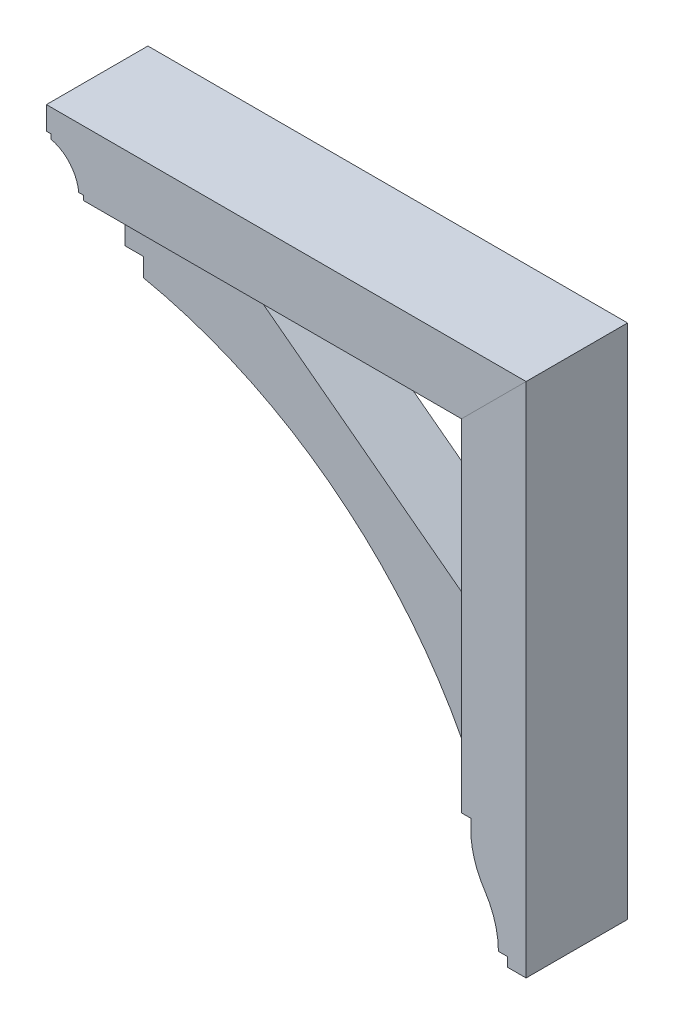
ISO-10303-21;
HEADER;
FILE_DESCRIPTION(('STEP AP214'),'2;1');
FILE_NAME('part.step','',(''),(''),'','','');
FILE_SCHEMA(('AUTOMOTIVE_DESIGN { 1 0 10303 214 1 1 1 1 }'));
ENDSEC;
DATA;
#1=APPLICATION_CONTEXT('core data for automotive mechanical design processes');
#2=APPLICATION_PROTOCOL_DEFINITION('international standard','automotive_design',2000,#1);
#3=PRODUCT_CONTEXT('',#1,'mechanical');
#4=PRODUCT('Part','Part','',(#3));
#5=PRODUCT_RELATED_PRODUCT_CATEGORY('part','',(#4));
#6=PRODUCT_DEFINITION_FORMATION('','',#4);
#7=PRODUCT_DEFINITION_CONTEXT('part definition',#1,'design');
#8=PRODUCT_DEFINITION('design','',#6,#7);
#9=PRODUCT_DEFINITION_SHAPE('','',#8);
#10=(LENGTH_UNIT() NAMED_UNIT(*) SI_UNIT(.MILLI.,.METRE.));
#11=(NAMED_UNIT(*) PLANE_ANGLE_UNIT() SI_UNIT($,.RADIAN.));
#12=(NAMED_UNIT(*) SI_UNIT($,.STERADIAN.) SOLID_ANGLE_UNIT());
#13=UNCERTAINTY_MEASURE_WITH_UNIT(LENGTH_MEASURE(1.E-05),#10,'distance_accuracy_value','');
#14=(GEOMETRIC_REPRESENTATION_CONTEXT(3) GLOBAL_UNCERTAINTY_ASSIGNED_CONTEXT((#13)) GLOBAL_UNIT_ASSIGNED_CONTEXT((#10,
#11,#12)) REPRESENTATION_CONTEXT('',''));
#15=CARTESIAN_POINT('',(0.,0.,0.));
#16=DIRECTION('',(0.,0.,1.));
#17=DIRECTION('',(1.,0.,0.));
#18=AXIS2_PLACEMENT_3D('',#15,#16,#17);
#19=CARTESIAN_POINT('',(246.881223015558,-2.15821431605898E-12,69.85));
#20=DIRECTION('',(1.,0.,0.));
#21=DIRECTION('',(0.,1.,0.));
#22=AXIS2_PLACEMENT_3D('',#19,#20,#21);
#23=PLANE('',#22);
#24=DIRECTION('',(0.,-1.,0.));
#25=VECTOR('',#24,1.);
#26=CARTESIAN_POINT('',(246.881223015558,-2.15821431605898E-12,-69.85));
#27=LINE('',#26,#25);
#28=CARTESIAN_POINT('',(246.881223015556,-183.515,-69.85));
#29=VERTEX_POINT('',#28);
#30=CARTESIAN_POINT('',(246.881223015556,-196.215,-69.85));
#31=VERTEX_POINT('',#30);
#32=EDGE_CURVE('E170',#29,#31,#27,.T.);
#33=ORIENTED_EDGE('',*,*,#32,.T.);
#34=DIRECTION('',(0.,0.,-1.));
#35=VECTOR('',#34,1.);
#36=CARTESIAN_POINT('',(246.881223015556,-196.215,69.85));
#37=LINE('',#36,#35);
#38=CARTESIAN_POINT('',(246.881223015556,-196.215,69.85));
#39=VERTEX_POINT('',#38);
#40=EDGE_CURVE('E12',#39,#31,#37,.T.);
#41=ORIENTED_EDGE('',*,*,#40,.F.);
#42=DIRECTION('',(0.,-1.,0.));
#43=VECTOR('',#42,1.);
#44=CARTESIAN_POINT('',(246.881223015558,-2.15821431605898E-12,69.85));
#45=LINE('',#44,#43);
#46=CARTESIAN_POINT('',(246.881223015556,-183.515,69.85));
#47=VERTEX_POINT('',#46);
#48=EDGE_CURVE('E203',#47,#39,#45,.T.);
#49=ORIENTED_EDGE('',*,*,#48,.F.);
#50=DIRECTION('',(0.,0.,-1.));
#51=VECTOR('',#50,1.);
#52=CARTESIAN_POINT('',(246.881223015556,-183.515,69.85));
#53=LINE('',#52,#51);
#54=EDGE_CURVE('E166',#47,#29,#53,.T.);
#55=ORIENTED_EDGE('',*,*,#54,.T.);
#56=EDGE_LOOP('',(#33,#41,#49,#55));
#57=FACE_BOUND('',#56,.T.);
#58=ADVANCED_FACE('F56',(#57),#23,.F.);
#59=CARTESIAN_POINT('',(362.768723015556,-196.215,69.85));
#60=DIRECTION('',(0.,0.,-1.));
#61=DIRECTION('',(-1.,0.,0.));
#62=AXIS2_PLACEMENT_3D('',#59,#60,#61);
#63=CYLINDRICAL_SURFACE('',#62,115.8875);
#64=CARTESIAN_POINT('',(362.768723015556,-196.215,-69.85));
#65=DIRECTION('',(0.,0.,1.));
#66=DIRECTION('',(1.,0.,0.));
#67=AXIS2_PLACEMENT_3D('',#64,#65,#66);
#68=CIRCLE('',#67,115.8875);
#69=CARTESIAN_POINT('',(266.018608336656,-260.006284403669,-69.85));
#70=VERTEX_POINT('',#69);
#71=EDGE_CURVE('E174',#31,#70,#68,.T.);
#72=ORIENTED_EDGE('',*,*,#71,.T.);
#73=DIRECTION('',(0.,0.,-1.));
#74=VECTOR('',#73,1.);
#75=CARTESIAN_POINT('',(266.018608336656,-260.006284403669,69.85));
#76=LINE('',#75,#74);
#77=CARTESIAN_POINT('',(266.018608336656,-260.006284403669,69.85));
#78=VERTEX_POINT('',#77);
#79=EDGE_CURVE('E65',#78,#70,#76,.T.);
#80=ORIENTED_EDGE('',*,*,#79,.F.);
#81=CARTESIAN_POINT('',(362.768723015556,-196.215,69.85));
#82=DIRECTION('',(0.,0.,1.));
#83=DIRECTION('',(1.,0.,0.));
#84=AXIS2_PLACEMENT_3D('',#81,#82,#83);
#85=CIRCLE('',#84,115.8875);
#86=EDGE_CURVE('E122',#39,#78,#85,.T.);
#87=ORIENTED_EDGE('',*,*,#86,.F.);
#88=ORIENTED_EDGE('',*,*,#40,.T.);
#89=EDGE_LOOP('',(#72,#80,#87,#88));
#90=FACE_BOUND('',#89,.T.);
#91=ADVANCED_FACE('F228',(#90),#63,.T.);
#92=CARTESIAN_POINT('',(170.152056348885,-323.215,69.85));
#93=DIRECTION('',(0.,0.,-1.));
#94=DIRECTION('',(-1.,0.,0.));
#95=AXIS2_PLACEMENT_3D('',#92,#93,#94);
#96=CYLINDRICAL_SURFACE('',#95,114.82916666667);
#97=CARTESIAN_POINT('',(170.152056348885,-323.215,-69.85));
#98=DIRECTION('',(0.,0.,1.));
#99=DIRECTION('',(1.,0.,0.));
#100=AXIS2_PLACEMENT_3D('',#97,#98,#99);
#101=CIRCLE('',#100,114.82916666667);
#102=CARTESIAN_POINT('',(284.981223015555,-323.215,-69.85));
#103=VERTEX_POINT('',#102);
#104=EDGE_CURVE('E178',#103,#70,#101,.T.);
#105=ORIENTED_EDGE('',*,*,#104,.F.);
#106=DIRECTION('',(0.,0.,-1.));
#107=VECTOR('',#106,1.);
#108=CARTESIAN_POINT('',(284.981223015555,-323.215,69.85));
#109=LINE('',#108,#107);
#110=CARTESIAN_POINT('',(284.981223015555,-323.215,69.85));
#111=VERTEX_POINT('',#110);
#112=EDGE_CURVE('E219',#111,#103,#109,.T.);
#113=ORIENTED_EDGE('',*,*,#112,.F.);
#114=CARTESIAN_POINT('',(170.152056348885,-323.215,69.85));
#115=DIRECTION('',(0.,0.,1.));
#116=DIRECTION('',(1.,0.,0.));
#117=AXIS2_PLACEMENT_3D('',#114,#115,#116);
#118=CIRCLE('',#117,114.82916666667);
#119=EDGE_CURVE('E227',#111,#78,#118,.T.);
#120=ORIENTED_EDGE('',*,*,#119,.T.);
#121=ORIENTED_EDGE('',*,*,#79,.T.);
#122=EDGE_LOOP('',(#105,#113,#120,#121));
#123=FACE_BOUND('',#122,.T.);
#124=ADVANCED_FACE('F225',(#123),#96,.F.);
#125=CARTESIAN_POINT('',(0.,-323.215,69.85));
#126=DIRECTION('',(0.,-1.,0.));
#127=DIRECTION('',(0.,0.,-1.));
#128=AXIS2_PLACEMENT_3D('',#125,#126,#127);
#129=PLANE('',#128);
#130=DIRECTION('',(-1.,0.,0.));
#131=VECTOR('',#130,1.);
#132=CARTESIAN_POINT('',(0.,-323.215,-69.85));
#133=LINE('',#132,#131);
#134=CARTESIAN_POINT('',(297.681223015555,-323.215,-69.85));
#135=VERTEX_POINT('',#134);
#136=EDGE_CURVE('E182',#135,#103,#133,.T.);
#137=ORIENTED_EDGE('',*,*,#136,.F.);
#138=DIRECTION('',(0.,0.,-1.));
#139=VECTOR('',#138,1.);
#140=CARTESIAN_POINT('',(297.681223015555,-323.215,69.85));
#141=LINE('',#140,#139);
#142=CARTESIAN_POINT('',(297.681223015555,-323.215,69.85));
#143=VERTEX_POINT('',#142);
#144=EDGE_CURVE('E216',#143,#135,#141,.T.);
#145=ORIENTED_EDGE('',*,*,#144,.F.);
#146=DIRECTION('',(-1.,0.,0.));
#147=VECTOR('',#146,1.);
#148=CARTESIAN_POINT('',(0.,-323.215,69.85));
#149=LINE('',#148,#147);
#150=EDGE_CURVE('E239',#143,#111,#149,.T.);
#151=ORIENTED_EDGE('',*,*,#150,.T.);
#152=ORIENTED_EDGE('',*,*,#112,.T.);
#153=EDGE_LOOP('',(#137,#145,#151,#152));
#154=FACE_BOUND('',#153,.T.);
#155=ADVANCED_FACE('F236',(#154),#129,.T.);
#156=CARTESIAN_POINT('',(297.681223015555,0.,69.85));
#157=DIRECTION('',(-1.,0.,0.));
#158=DIRECTION('',(0.,0.,1.));
#159=AXIS2_PLACEMENT_3D('',#156,#157,#158);
#160=PLANE('',#159);
#161=DIRECTION('',(0.,1.,0.));
#162=VECTOR('',#161,1.);
#163=CARTESIAN_POINT('',(297.681223015555,0.,-69.85));
#164=LINE('',#163,#162);
#165=CARTESIAN_POINT('',(297.681223015555,-335.915,-69.85));
#166=VERTEX_POINT('',#165);
#167=EDGE_CURVE('E186',#166,#135,#164,.T.);
#168=ORIENTED_EDGE('',*,*,#167,.F.);
#169=DIRECTION('',(0.,0.,-1.));
#170=VECTOR('',#169,1.);
#171=CARTESIAN_POINT('',(297.681223015555,-335.915,69.85));
#172=LINE('',#171,#170);
#173=CARTESIAN_POINT('',(297.681223015555,-335.915,69.85));
#174=VERTEX_POINT('',#173);
#175=EDGE_CURVE('E213',#174,#166,#172,.T.);
#176=ORIENTED_EDGE('',*,*,#175,.F.);
#177=DIRECTION('',(0.,1.,0.));
#178=VECTOR('',#177,1.);
#179=CARTESIAN_POINT('',(297.681223015555,0.,69.85));
#180=LINE('',#179,#178);
#181=EDGE_CURVE('E246',#174,#143,#180,.T.);
#182=ORIENTED_EDGE('',*,*,#181,.T.);
#183=ORIENTED_EDGE('',*,*,#144,.T.);
#184=EDGE_LOOP('',(#168,#176,#182,#183));
#185=FACE_BOUND('',#184,.T.);
#186=ADVANCED_FACE('F261',(#185),#160,.T.);
#187=CARTESIAN_POINT('',(7.34134975033387E-13,-335.915000000001,69.85));
#188=DIRECTION('',(0.,-1.,0.));
#189=DIRECTION('',(1.,0.,0.));
#190=AXIS2_PLACEMENT_3D('',#187,#188,#189);
#191=PLANE('',#190);
#192=DIRECTION('',(-1.,0.,0.));
#193=VECTOR('',#192,1.);
#194=CARTESIAN_POINT('',(7.34134975033387E-13,-335.915000000001,-69.85));
#195=LINE('',#194,#193);
#196=CARTESIAN_POINT('',(323.081223015555,-335.915,-69.85));
#197=VERTEX_POINT('',#196);
#198=EDGE_CURVE('E190',#197,#166,#195,.T.);
#199=ORIENTED_EDGE('',*,*,#198,.F.);
#200=DIRECTION('',(0.,0.,-1.));
#201=VECTOR('',#200,1.);
#202=CARTESIAN_POINT('',(323.081223015555,-335.915,69.85));
#203=LINE('',#202,#201);
#204=CARTESIAN_POINT('',(323.081223015555,-335.915,69.85));
#205=VERTEX_POINT('',#204);
#206=EDGE_CURVE('E210',#205,#197,#203,.T.);
#207=ORIENTED_EDGE('',*,*,#206,.F.);
#208=DIRECTION('',(-1.,0.,0.));
#209=VECTOR('',#208,1.);
#210=CARTESIAN_POINT('',(7.34134975033387E-13,-335.915000000001,69.85));
#211=LINE('',#210,#209);
#212=EDGE_CURVE('E253',#205,#174,#211,.T.);
#213=ORIENTED_EDGE('',*,*,#212,.T.);
#214=ORIENTED_EDGE('',*,*,#175,.T.);
#215=EDGE_LOOP('',(#199,#207,#213,#214));
#216=FACE_BOUND('',#215,.T.);
#217=ADVANCED_FACE('F259',(#216),#191,.T.);
#218=CARTESIAN_POINT('',(323.081223015555,0.,69.85));
#219=DIRECTION('',(-1.,0.,0.));
#220=DIRECTION('',(0.,0.,1.));
#221=AXIS2_PLACEMENT_3D('',#218,#219,#220);
#222=PLANE('',#221);
#223=DIRECTION('',(0.,1.,0.));
#224=VECTOR('',#223,1.);
#225=CARTESIAN_POINT('',(323.081223015555,0.,-69.85));
#226=LINE('',#225,#224);
#227=CARTESIAN_POINT('',(323.081223015555,375.285,-69.85));
#228=VERTEX_POINT('',#227);
#229=EDGE_CURVE('E194',#197,#228,#226,.T.);
#230=ORIENTED_EDGE('',*,*,#229,.T.);
#231=DIRECTION('',(0.,0.,-1.));
#232=VECTOR('',#231,1.);
#233=CARTESIAN_POINT('',(323.081223015555,375.285,69.85));
#234=LINE('',#233,#232);
#235=CARTESIAN_POINT('',(323.081223015555,375.285,69.85));
#236=VERTEX_POINT('',#235);
#237=EDGE_CURVE('E159',#236,#228,#234,.T.);
#238=ORIENTED_EDGE('',*,*,#237,.F.);
#239=DIRECTION('',(0.,1.,0.));
#240=VECTOR('',#239,1.);
#241=CARTESIAN_POINT('',(323.081223015555,0.,69.85));
#242=LINE('',#241,#240);
#243=EDGE_CURVE('E148',#205,#236,#242,.T.);
#244=ORIENTED_EDGE('',*,*,#243,.F.);
#245=ORIENTED_EDGE('',*,*,#206,.T.);
#246=EDGE_LOOP('',(#230,#238,#244,#245));
#247=FACE_BOUND('',#246,.T.);
#248=ADVANCED_FACE('F264',(#247),#222,.F.);
#249=CARTESIAN_POINT('',(-26.1018884922205,26.1018884922201,69.85));
#250=DIRECTION('',(0.707106781186552,-0.707106781186543,0.));
#251=DIRECTION('',(0.707106781186543,0.707106781186552,0.));
#252=AXIS2_PLACEMENT_3D('',#249,#250,#251);
#253=PLANE('',#252);
#254=DIRECTION('',(-0.707106781186543,-0.707106781186552,0.));
#255=VECTOR('',#254,1.);
#256=CARTESIAN_POINT('',(-26.1018884922205,26.1018884922201,-69.85));
#257=LINE('',#256,#255);
#258=CARTESIAN_POINT('',(234.181223015556,286.385,-69.85));
#259=VERTEX_POINT('',#258);
#260=EDGE_CURVE('E157',#228,#259,#257,.T.);
#261=ORIENTED_EDGE('',*,*,#260,.T.);
#262=DIRECTION('',(0.,0.,-1.));
#263=VECTOR('',#262,1.);
#264=CARTESIAN_POINT('',(234.181223015556,286.385,69.85));
#265=LINE('',#264,#263);
#266=CARTESIAN_POINT('',(234.181223015556,286.385,69.85));
#267=VERTEX_POINT('',#266);
#268=EDGE_CURVE('E154',#267,#259,#265,.T.);
#269=ORIENTED_EDGE('',*,*,#268,.F.);
#270=DIRECTION('',(-0.707106781186543,-0.707106781186552,0.));
#271=VECTOR('',#270,1.);
#272=CARTESIAN_POINT('',(-26.1018884922205,26.1018884922201,69.85));
#273=LINE('',#272,#271);
#274=EDGE_CURVE('E141',#236,#267,#273,.T.);
#275=ORIENTED_EDGE('',*,*,#274,.F.);
#276=ORIENTED_EDGE('',*,*,#237,.T.);
#277=EDGE_LOOP('',(#261,#269,#275,#276));
#278=FACE_BOUND('',#277,.T.);
#279=ADVANCED_FACE('F155',(#278),#253,.F.);
#280=CARTESIAN_POINT('',(234.181223015556,0.,69.85));
#281=DIRECTION('',(1.,0.,0.));
#282=DIRECTION('',(0.,1.,0.));
#283=AXIS2_PLACEMENT_3D('',#280,#281,#282);
#284=PLANE('',#283);
#285=DIRECTION('',(0.,-1.,0.));
#286=VECTOR('',#285,1.);
#287=CARTESIAN_POINT('',(234.181223015556,0.,-69.85));
#288=LINE('',#287,#286);
#289=CARTESIAN_POINT('',(234.181223015556,-183.515,-69.85));
#290=VERTEX_POINT('',#289);
#291=EDGE_CURVE('E108',#259,#290,#288,.T.);
#292=ORIENTED_EDGE('',*,*,#291,.T.);
#293=DIRECTION('',(0.,0.,-1.));
#294=VECTOR('',#293,1.);
#295=CARTESIAN_POINT('',(234.181223015556,-183.515,69.85));
#296=LINE('',#295,#294);
#297=CARTESIAN_POINT('',(234.181223015556,-183.515,69.85));
#298=VERTEX_POINT('',#297);
#299=EDGE_CURVE('E160',#298,#290,#296,.T.);
#300=ORIENTED_EDGE('',*,*,#299,.F.);
#301=DIRECTION('',(0.,-1.,0.));
#302=VECTOR('',#301,1.);
#303=CARTESIAN_POINT('',(234.181223015556,0.,69.85));
#304=LINE('',#303,#302);
#305=EDGE_CURVE('E145',#267,#298,#304,.T.);
#306=ORIENTED_EDGE('',*,*,#305,.F.);
#307=ORIENTED_EDGE('',*,*,#268,.T.);
#308=EDGE_LOOP('',(#292,#300,#306,#307));
#309=FACE_BOUND('',#308,.T.);
#310=ADVANCED_FACE('F162',(#309),#284,.F.);
#311=CARTESIAN_POINT('',(0.,-183.515,69.85));
#312=DIRECTION('',(0.,1.,0.));
#313=DIRECTION('',(0.,0.,1.));
#314=AXIS2_PLACEMENT_3D('',#311,#312,#313);
#315=PLANE('',#314);
#316=DIRECTION('',(1.,0.,0.));
#317=VECTOR('',#316,1.);
#318=CARTESIAN_POINT('',(0.,-183.515,-69.85));
#319=LINE('',#318,#317);
#320=EDGE_CURVE('E114',#290,#29,#319,.T.);
#321=ORIENTED_EDGE('',*,*,#320,.T.);
#322=ORIENTED_EDGE('',*,*,#54,.F.);
#323=DIRECTION('',(1.,0.,0.));
#324=VECTOR('',#323,1.);
#325=CARTESIAN_POINT('',(0.,-183.515,69.85));
#326=LINE('',#325,#324);
#327=EDGE_CURVE('E73',#298,#47,#326,.T.);
#328=ORIENTED_EDGE('',*,*,#327,.F.);
#329=ORIENTED_EDGE('',*,*,#299,.T.);
#330=EDGE_LOOP('',(#321,#322,#328,#329));
#331=FACE_BOUND('',#330,.T.);
#332=ADVANCED_FACE('F279',(#331),#315,.F.);
#333=CARTESIAN_POINT('',(0.,0.,69.85));
#334=DIRECTION('',(0.,0.,1.));
#335=DIRECTION('',(1.,0.,0.));
#336=AXIS2_PLACEMENT_3D('',#333,#334,#335);
#337=PLANE('',#336);
#338=ORIENTED_EDGE('',*,*,#48,.T.);
#339=ORIENTED_EDGE('',*,*,#86,.T.);
#340=ORIENTED_EDGE('',*,*,#119,.F.);
#341=ORIENTED_EDGE('',*,*,#150,.F.);
#342=ORIENTED_EDGE('',*,*,#181,.F.);
#343=ORIENTED_EDGE('',*,*,#212,.F.);
#344=ORIENTED_EDGE('',*,*,#243,.T.);
#345=ORIENTED_EDGE('',*,*,#274,.T.);
#346=ORIENTED_EDGE('',*,*,#305,.T.);
#347=ORIENTED_EDGE('',*,*,#327,.T.);
#348=EDGE_LOOP('',(#338,#339,#340,#341,#342,#343,#344,#345,#346,#347));
#349=FACE_BOUND('',#348,.T.);
#350=ADVANCED_FACE('F143',(#349),#337,.T.);
#351=CARTESIAN_POINT('',(0.,0.,-69.85));
#352=DIRECTION('',(0.,0.,1.));
#353=DIRECTION('',(1.,0.,0.));
#354=AXIS2_PLACEMENT_3D('',#351,#352,#353);
#355=PLANE('',#354);
#356=ORIENTED_EDGE('',*,*,#32,.F.);
#357=ORIENTED_EDGE('',*,*,#320,.F.);
#358=ORIENTED_EDGE('',*,*,#291,.F.);
#359=ORIENTED_EDGE('',*,*,#260,.F.);
#360=ORIENTED_EDGE('',*,*,#229,.F.);
#361=ORIENTED_EDGE('',*,*,#198,.T.);
#362=ORIENTED_EDGE('',*,*,#167,.T.);
#363=ORIENTED_EDGE('',*,*,#136,.T.);
#364=ORIENTED_EDGE('',*,*,#104,.T.);
#365=ORIENTED_EDGE('',*,*,#71,.F.);
#366=EDGE_LOOP('',(#356,#357,#358,#359,#360,#361,#362,#363,#364,#365));
#367=FACE_BOUND('',#366,.T.);
#368=ADVANCED_FACE('F232',(#367),#355,.F.);
#369=CLOSED_SHELL('',(#58,#91,#124,#155,#186,#217,#248,#279,#310,#332,#350,#368));
#370=MANIFOLD_SOLID_BREP('B2',#369);
#371=CARTESIAN_POINT('',(-229.368776984445,0.,44.45));
#372=DIRECTION('',(1.,0.,0.));
#373=DIRECTION('',(0.,0.,-1.));
#374=AXIS2_PLACEMENT_3D('',#371,#372,#373);
#375=PLANE('',#374);
#376=DIRECTION('',(0.,-1.,0.));
#377=VECTOR('',#376,1.);
#378=CARTESIAN_POINT('',(-229.368776984445,0.,-44.45));
#379=LINE('',#378,#377);
#380=CARTESIAN_POINT('',(-229.368776984445,235.585,-44.45));
#381=VERTEX_POINT('',#380);
#382=CARTESIAN_POINT('',(-229.368776984445,210.185,-44.45));
#383=VERTEX_POINT('',#382);
#384=EDGE_CURVE('E485',#381,#383,#379,.T.);
#385=ORIENTED_EDGE('',*,*,#384,.T.);
#386=DIRECTION('',(0.,0.,-1.));
#387=VECTOR('',#386,1.);
#388=CARTESIAN_POINT('',(-229.368776984445,210.185,44.45));
#389=LINE('',#388,#387);
#390=CARTESIAN_POINT('',(-229.368776984445,210.185,44.45));
#391=VERTEX_POINT('',#390);
#392=EDGE_CURVE('E54',#391,#383,#389,.T.);
#393=ORIENTED_EDGE('',*,*,#392,.F.);
#394=DIRECTION('',(0.,-1.,0.));
#395=VECTOR('',#394,1.);
#396=CARTESIAN_POINT('',(-229.368776984445,0.,44.45));
#397=LINE('',#396,#395);
#398=CARTESIAN_POINT('',(-229.368776984445,235.585,44.45));
#399=VERTEX_POINT('',#398);
#400=EDGE_CURVE('E503',#399,#391,#397,.T.);
#401=ORIENTED_EDGE('',*,*,#400,.F.);
#402=DIRECTION('',(0.,0.,-1.));
#403=VECTOR('',#402,1.);
#404=CARTESIAN_POINT('',(-229.368776984445,235.585,44.45));
#405=LINE('',#404,#403);
#406=EDGE_CURVE('E484',#399,#381,#405,.T.);
#407=ORIENTED_EDGE('',*,*,#406,.T.);
#408=EDGE_LOOP('',(#385,#393,#401,#407));
#409=FACE_BOUND('',#408,.T.);
#410=ADVANCED_FACE('F387',(#409),#375,.F.);
#411=CARTESIAN_POINT('',(-359.19978812044,-417.886437853534,44.45));
#412=DIRECTION('',(0.,0.,-1.));
#413=DIRECTION('',(-1.,0.,0.));
#414=AXIS2_PLACEMENT_3D('',#411,#412,#413);
#415=CYLINDRICAL_SURFACE('',#414,641.35);
#416=CARTESIAN_POINT('',(-359.19978812044,-417.886437853534,-44.45));
#417=DIRECTION('',(0.,0.,1.));
#418=DIRECTION('',(1.,0.,0.));
#419=AXIS2_PLACEMENT_3D('',#416,#417,#418);
#420=CIRCLE('',#419,641.35);
#421=CARTESIAN_POINT('',(208.781223015556,-120.015,-44.45));
#422=VERTEX_POINT('',#421);
#423=EDGE_CURVE('E488',#383,#422,#420,.F.);
#424=ORIENTED_EDGE('',*,*,#423,.T.);
#425=DIRECTION('',(0.,0.,-1.));
#426=VECTOR('',#425,1.);
#427=CARTESIAN_POINT('',(208.781223015556,-120.015,44.45));
#428=LINE('',#427,#426);
#429=CARTESIAN_POINT('',(208.781223015556,-120.015,44.45));
#430=VERTEX_POINT('',#429);
#431=EDGE_CURVE('E395',#430,#422,#428,.T.);
#432=ORIENTED_EDGE('',*,*,#431,.F.);
#433=CARTESIAN_POINT('',(-359.19978812044,-417.886437853534,44.45));
#434=DIRECTION('',(0.,0.,1.));
#435=DIRECTION('',(1.,0.,0.));
#436=AXIS2_PLACEMENT_3D('',#433,#434,#435);
#437=CIRCLE('',#436,641.35);
#438=EDGE_CURVE('E445',#391,#430,#437,.F.);
#439=ORIENTED_EDGE('',*,*,#438,.F.);
#440=ORIENTED_EDGE('',*,*,#392,.T.);
#441=EDGE_LOOP('',(#424,#432,#439,#440));
#442=FACE_BOUND('',#441,.T.);
#443=ADVANCED_FACE('F516',(#442),#415,.F.);
#444=CARTESIAN_POINT('',(0.,-120.015,44.45));
#445=DIRECTION('',(0.,-1.,0.));
#446=DIRECTION('',(0.,0.,-1.));
#447=AXIS2_PLACEMENT_3D('',#444,#445,#446);
#448=PLANE('',#447);
#449=DIRECTION('',(-1.,0.,0.));
#450=VECTOR('',#449,1.);
#451=CARTESIAN_POINT('',(0.,-120.015,-44.45));
#452=LINE('',#451,#450);
#453=CARTESIAN_POINT('',(234.181223015556,-120.015,-44.45));
#454=VERTEX_POINT('',#453);
#455=EDGE_CURVE('E491',#454,#422,#452,.T.);
#456=ORIENTED_EDGE('',*,*,#455,.F.);
#457=DIRECTION('',(0.,0.,-1.));
#458=VECTOR('',#457,1.);
#459=CARTESIAN_POINT('',(234.181223015556,-120.015,44.45));
#460=LINE('',#459,#458);
#461=CARTESIAN_POINT('',(234.181223015556,-120.015,44.45));
#462=VERTEX_POINT('',#461);
#463=EDGE_CURVE('E509',#462,#454,#460,.T.);
#464=ORIENTED_EDGE('',*,*,#463,.F.);
#465=DIRECTION('',(-1.,0.,0.));
#466=VECTOR('',#465,1.);
#467=CARTESIAN_POINT('',(0.,-120.015,44.45));
#468=LINE('',#467,#466);
#469=EDGE_CURVE('E515',#462,#430,#468,.T.);
#470=ORIENTED_EDGE('',*,*,#469,.T.);
#471=ORIENTED_EDGE('',*,*,#431,.T.);
#472=EDGE_LOOP('',(#456,#464,#470,#471));
#473=FACE_BOUND('',#472,.T.);
#474=ADVANCED_FACE('F513',(#473),#448,.T.);
#475=CARTESIAN_POINT('',(234.181223015556,0.,44.45));
#476=DIRECTION('',(1.,0.,0.));
#477=DIRECTION('',(0.,1.,0.));
#478=AXIS2_PLACEMENT_3D('',#475,#476,#477);
#479=PLANE('',#478);
#480=DIRECTION('',(0.,-1.,0.));
#481=VECTOR('',#480,1.);
#482=CARTESIAN_POINT('',(234.181223015556,0.,-44.45));
#483=LINE('',#482,#481);
#484=CARTESIAN_POINT('',(234.181223015556,35.5599999999998,-44.45));
#485=VERTEX_POINT('',#484);
#486=EDGE_CURVE('E494',#485,#454,#483,.T.);
#487=ORIENTED_EDGE('',*,*,#486,.F.);
#488=DIRECTION('',(0.,0.,-1.));
#489=VECTOR('',#488,1.);
#490=CARTESIAN_POINT('',(234.181223015556,35.5599999999998,44.45));
#491=LINE('',#490,#489);
#492=CARTESIAN_POINT('',(234.181223015556,35.5599999999998,44.45));
#493=VERTEX_POINT('',#492);
#494=EDGE_CURVE('E507',#493,#485,#491,.T.);
#495=ORIENTED_EDGE('',*,*,#494,.F.);
#496=DIRECTION('',(0.,-1.,0.));
#497=VECTOR('',#496,1.);
#498=CARTESIAN_POINT('',(234.181223015556,0.,44.45));
#499=LINE('',#498,#497);
#500=EDGE_CURVE('E479',#493,#462,#499,.T.);
#501=ORIENTED_EDGE('',*,*,#500,.T.);
#502=ORIENTED_EDGE('',*,*,#463,.T.);
#503=EDGE_LOOP('',(#487,#495,#501,#502));
#504=FACE_BOUND('',#503,.T.);
#505=ADVANCED_FACE('F524',(#504),#479,.T.);
#506=CARTESIAN_POINT('',(102.270556797441,135.281939054843,44.45));
#507=DIRECTION('',(0.603049042546717,0.797704113242177,0.));
#508=DIRECTION('',(-0.797704113242177,0.603049042546717,0.));
#509=AXIS2_PLACEMENT_3D('',#506,#507,#508);
#510=PLANE('',#509);
#511=DIRECTION('',(0.797704113242177,-0.603049042546717,0.));
#512=VECTOR('',#511,1.);
#513=CARTESIAN_POINT('',(102.270556797441,135.281939054843,-44.45));
#514=LINE('',#513,#512);
#515=CARTESIAN_POINT('',(-97.6062769844443,286.385,-44.45));
#516=VERTEX_POINT('',#515);
#517=EDGE_CURVE('E497',#516,#485,#514,.T.);
#518=ORIENTED_EDGE('',*,*,#517,.F.);
#519=DIRECTION('',(0.,0.,-1.));
#520=VECTOR('',#519,1.);
#521=CARTESIAN_POINT('',(-97.6062769844443,286.385,44.45));
#522=LINE('',#521,#520);
#523=CARTESIAN_POINT('',(-97.6062769844443,286.385,44.45));
#524=VERTEX_POINT('',#523);
#525=EDGE_CURVE('E467',#524,#516,#522,.T.);
#526=ORIENTED_EDGE('',*,*,#525,.F.);
#527=DIRECTION('',(0.797704113242177,-0.603049042546717,0.));
#528=VECTOR('',#527,1.);
#529=CARTESIAN_POINT('',(102.270556797441,135.281939054843,44.45));
#530=LINE('',#529,#528);
#531=EDGE_CURVE('E477',#524,#493,#530,.T.);
#532=ORIENTED_EDGE('',*,*,#531,.T.);
#533=ORIENTED_EDGE('',*,*,#494,.T.);
#534=EDGE_LOOP('',(#518,#526,#532,#533));
#535=FACE_BOUND('',#534,.T.);
#536=ADVANCED_FACE('F552',(#535),#510,.T.);
#537=CARTESIAN_POINT('',(0.,286.385,44.45));
#538=DIRECTION('',(0.,1.,0.));
#539=DIRECTION('',(0.,0.,1.));
#540=AXIS2_PLACEMENT_3D('',#537,#538,#539);
#541=PLANE('',#540);
#542=DIRECTION('',(1.,0.,0.));
#543=VECTOR('',#542,1.);
#544=CARTESIAN_POINT('',(0.,286.385,-44.45));
#545=LINE('',#544,#543);
#546=CARTESIAN_POINT('',(-254.768776984445,286.385,-44.45));
#547=VERTEX_POINT('',#546);
#548=EDGE_CURVE('E466',#547,#516,#545,.T.);
#549=ORIENTED_EDGE('',*,*,#548,.F.);
#550=DIRECTION('',(0.,0.,-1.));
#551=VECTOR('',#550,1.);
#552=CARTESIAN_POINT('',(-254.768776984445,286.385,44.45));
#553=LINE('',#552,#551);
#554=CARTESIAN_POINT('',(-254.768776984445,286.385,44.45));
#555=VERTEX_POINT('',#554);
#556=EDGE_CURVE('E460',#555,#547,#553,.T.);
#557=ORIENTED_EDGE('',*,*,#556,.F.);
#558=DIRECTION('',(1.,0.,0.));
#559=VECTOR('',#558,1.);
#560=CARTESIAN_POINT('',(0.,286.385,44.45));
#561=LINE('',#560,#559);
#562=EDGE_CURVE('E464',#555,#524,#561,.T.);
#563=ORIENTED_EDGE('',*,*,#562,.T.);
#564=ORIENTED_EDGE('',*,*,#525,.T.);
#565=EDGE_LOOP('',(#549,#557,#563,#564));
#566=FACE_BOUND('',#565,.T.);
#567=ADVANCED_FACE('F462',(#566),#541,.T.);
#568=CARTESIAN_POINT('',(-254.768776984445,-2.78395828901301E-13,44.45));
#569=DIRECTION('',(1.,0.,0.));
#570=DIRECTION('',(0.,1.,0.));
#571=AXIS2_PLACEMENT_3D('',#568,#569,#570);
#572=PLANE('',#571);
#573=DIRECTION('',(0.,-1.,0.));
#574=VECTOR('',#573,1.);
#575=CARTESIAN_POINT('',(-254.768776984445,-2.78395828901301E-13,-44.45));
#576=LINE('',#575,#574);
#577=CARTESIAN_POINT('',(-254.768776984445,235.585,-44.45));
#578=VERTEX_POINT('',#577);
#579=EDGE_CURVE('E431',#547,#578,#576,.T.);
#580=ORIENTED_EDGE('',*,*,#579,.T.);
#581=DIRECTION('',(0.,0.,-1.));
#582=VECTOR('',#581,1.);
#583=CARTESIAN_POINT('',(-254.768776984445,235.585,44.45));
#584=LINE('',#583,#582);
#585=CARTESIAN_POINT('',(-254.768776984445,235.585,44.45));
#586=VERTEX_POINT('',#585);
#587=EDGE_CURVE('E468',#586,#578,#584,.T.);
#588=ORIENTED_EDGE('',*,*,#587,.F.);
#589=DIRECTION('',(0.,-1.,0.));
#590=VECTOR('',#589,1.);
#591=CARTESIAN_POINT('',(-254.768776984445,-2.78395828901301E-13,44.45));
#592=LINE('',#591,#590);
#593=EDGE_CURVE('E470',#555,#586,#592,.T.);
#594=ORIENTED_EDGE('',*,*,#593,.F.);
#595=ORIENTED_EDGE('',*,*,#556,.T.);
#596=EDGE_LOOP('',(#580,#588,#594,#595));
#597=FACE_BOUND('',#596,.T.);
#598=ADVANCED_FACE('F471',(#597),#572,.F.);
#599=CARTESIAN_POINT('',(0.,235.585,44.45));
#600=DIRECTION('',(0.,1.,0.));
#601=DIRECTION('',(0.,0.,1.));
#602=AXIS2_PLACEMENT_3D('',#599,#600,#601);
#603=PLANE('',#602);
#604=DIRECTION('',(1.,0.,0.));
#605=VECTOR('',#604,1.);
#606=CARTESIAN_POINT('',(0.,235.585,-44.45));
#607=LINE('',#606,#605);
#608=EDGE_CURVE('E437',#578,#381,#607,.T.);
#609=ORIENTED_EDGE('',*,*,#608,.T.);
#610=ORIENTED_EDGE('',*,*,#406,.F.);
#611=DIRECTION('',(1.,0.,0.));
#612=VECTOR('',#611,1.);
#613=CARTESIAN_POINT('',(0.,235.585,44.45));
#614=LINE('',#613,#612);
#615=EDGE_CURVE('E403',#586,#399,#614,.T.);
#616=ORIENTED_EDGE('',*,*,#615,.F.);
#617=ORIENTED_EDGE('',*,*,#587,.T.);
#618=EDGE_LOOP('',(#609,#610,#616,#617));
#619=FACE_BOUND('',#618,.T.);
#620=ADVANCED_FACE('F531',(#619),#603,.F.);
#621=CARTESIAN_POINT('',(0.,0.,44.45));
#622=DIRECTION('',(0.,0.,1.));
#623=DIRECTION('',(1.,0.,0.));
#624=AXIS2_PLACEMENT_3D('',#621,#622,#623);
#625=PLANE('',#624);
#626=ORIENTED_EDGE('',*,*,#400,.T.);
#627=ORIENTED_EDGE('',*,*,#438,.T.);
#628=ORIENTED_EDGE('',*,*,#469,.F.);
#629=ORIENTED_EDGE('',*,*,#500,.F.);
#630=ORIENTED_EDGE('',*,*,#531,.F.);
#631=ORIENTED_EDGE('',*,*,#562,.F.);
#632=ORIENTED_EDGE('',*,*,#593,.T.);
#633=ORIENTED_EDGE('',*,*,#615,.T.);
#634=EDGE_LOOP('',(#626,#627,#628,#629,#630,#631,#632,#633));
#635=FACE_BOUND('',#634,.T.);
#636=ADVANCED_FACE('F474',(#635),#625,.T.);
#637=CARTESIAN_POINT('',(0.,0.,-44.45));
#638=DIRECTION('',(0.,0.,1.));
#639=DIRECTION('',(1.,0.,0.));
#640=AXIS2_PLACEMENT_3D('',#637,#638,#639);
#641=PLANE('',#640);
#642=ORIENTED_EDGE('',*,*,#384,.F.);
#643=ORIENTED_EDGE('',*,*,#608,.F.);
#644=ORIENTED_EDGE('',*,*,#579,.F.);
#645=ORIENTED_EDGE('',*,*,#548,.T.);
#646=ORIENTED_EDGE('',*,*,#517,.T.);
#647=ORIENTED_EDGE('',*,*,#486,.T.);
#648=ORIENTED_EDGE('',*,*,#455,.T.);
#649=ORIENTED_EDGE('',*,*,#423,.F.);
#650=EDGE_LOOP('',(#642,#643,#644,#645,#646,#647,#648,#649));
#651=FACE_BOUND('',#650,.T.);
#652=ADVANCED_FACE('F520',(#651),#641,.F.);
#653=CLOSED_SHELL('',(#410,#443,#474,#505,#536,#567,#598,#620,#636,#652));
#654=MANIFOLD_SOLID_BREP('B6',#653);
#655=CARTESIAN_POINT('',(-330.968776984439,-5.78660089197089E-12,69.85));
#656=DIRECTION('',(-1.,0.,0.));
#657=DIRECTION('',(0.,-1.,0.));
#658=AXIS2_PLACEMENT_3D('',#655,#656,#657);
#659=PLANE('',#658);
#660=DIRECTION('',(0.,1.,0.));
#661=VECTOR('',#660,1.);
#662=CARTESIAN_POINT('',(-330.968776984439,-5.78660089197089E-12,-69.85));
#663=LINE('',#662,#661);
#664=CARTESIAN_POINT('',(-330.968776984445,337.185,-69.85));
#665=VERTEX_POINT('',#664);
#666=CARTESIAN_POINT('',(-330.968776984445,343.535,-69.85));
#667=VERTEX_POINT('',#666);
#668=EDGE_CURVE('E724',#665,#667,#663,.T.);
#669=ORIENTED_EDGE('',*,*,#668,.F.);
#670=DIRECTION('',(0.,0.,-1.));
#671=VECTOR('',#670,1.);
#672=CARTESIAN_POINT('',(-330.968776984445,337.185,69.85));
#673=LINE('',#672,#671);
#674=CARTESIAN_POINT('',(-330.968776984445,337.185,69.85));
#675=VERTEX_POINT('',#674);
#676=EDGE_CURVE('E385',#675,#665,#673,.T.);
#677=ORIENTED_EDGE('',*,*,#676,.F.);
#678=DIRECTION('',(0.,1.,0.));
#679=VECTOR('',#678,1.);
#680=CARTESIAN_POINT('',(-330.968776984439,-5.78660089197089E-12,69.85));
#681=LINE('',#680,#679);
#682=CARTESIAN_POINT('',(-330.968776984445,343.535,69.85));
#683=VERTEX_POINT('',#682);
#684=EDGE_CURVE('E747',#675,#683,#681,.T.);
#685=ORIENTED_EDGE('',*,*,#684,.T.);
#686=DIRECTION('',(0.,0.,-1.));
#687=VECTOR('',#686,1.);
#688=CARTESIAN_POINT('',(-330.968776984445,343.535,69.85));
#689=LINE('',#688,#687);
#690=EDGE_CURVE('E641',#683,#667,#689,.T.);
#691=ORIENTED_EDGE('',*,*,#690,.T.);
#692=EDGE_LOOP('',(#669,#677,#685,#691));
#693=FACE_BOUND('',#692,.T.);
#694=ADVANCED_FACE('F625',(#693),#659,.T.);
#695=CARTESIAN_POINT('',(-343.380101736884,287.993150212195,69.85));
#696=DIRECTION('',(0.,0.,-1.));
#697=DIRECTION('',(-1.,0.,0.));
#698=AXIS2_PLACEMENT_3D('',#695,#696,#697);
#699=CYLINDRICAL_SURFACE('',#698,50.7334117486339);
#700=CARTESIAN_POINT('',(-343.380101736884,287.993150212195,-69.85));
#701=DIRECTION('',(0.,0.,1.));
#702=DIRECTION('',(1.,0.,0.));
#703=AXIS2_PLACEMENT_3D('',#700,#701,#702);
#704=CIRCLE('',#703,50.7334117486339);
#705=CARTESIAN_POINT('',(-292.868776984445,292.735,-69.85));
#706=VERTEX_POINT('',#705);
#707=EDGE_CURVE('E726',#665,#706,#704,.F.);
#708=ORIENTED_EDGE('',*,*,#707,.T.);
#709=DIRECTION('',(0.,0.,-1.));
#710=VECTOR('',#709,1.);
#711=CARTESIAN_POINT('',(-292.868776984445,292.735,69.85));
#712=LINE('',#711,#710);
#713=CARTESIAN_POINT('',(-292.868776984445,292.735,69.85));
#714=VERTEX_POINT('',#713);
#715=EDGE_CURVE('E633',#714,#706,#712,.T.);
#716=ORIENTED_EDGE('',*,*,#715,.F.);
#717=CARTESIAN_POINT('',(-343.380101736884,287.993150212195,69.85));
#718=DIRECTION('',(0.,0.,1.));
#719=DIRECTION('',(1.,0.,0.));
#720=AXIS2_PLACEMENT_3D('',#717,#718,#719);
#721=CIRCLE('',#720,50.7334117486339);
#722=EDGE_CURVE('E776',#675,#714,#721,.F.);
#723=ORIENTED_EDGE('',*,*,#722,.F.);
#724=ORIENTED_EDGE('',*,*,#676,.T.);
#725=EDGE_LOOP('',(#708,#716,#723,#724));
#726=FACE_BOUND('',#725,.T.);
#727=ADVANCED_FACE('F765',(#726),#699,.F.);
#728=CARTESIAN_POINT('',(-2.559064071761E-12,292.735000000002,69.85));
#729=DIRECTION('',(0.,-1.,0.));
#730=DIRECTION('',(1.,0.,0.));
#731=AXIS2_PLACEMENT_3D('',#728,#729,#730);
#732=PLANE('',#731);
#733=DIRECTION('',(-1.,0.,0.));
#734=VECTOR('',#733,1.);
#735=CARTESIAN_POINT('',(-2.559064071761E-12,292.735000000002,-69.85));
#736=LINE('',#735,#734);
#737=CARTESIAN_POINT('',(-286.518776984445,292.735,-69.85));
#738=VERTEX_POINT('',#737);
#739=EDGE_CURVE('E729',#738,#706,#736,.T.);
#740=ORIENTED_EDGE('',*,*,#739,.F.);
#741=DIRECTION('',(0.,0.,-1.));
#742=VECTOR('',#741,1.);
#743=CARTESIAN_POINT('',(-286.518776984445,292.735,69.85));
#744=LINE('',#743,#742);
#745=CARTESIAN_POINT('',(-286.518776984445,292.735,69.85));
#746=VERTEX_POINT('',#745);
#747=EDGE_CURVE('E755',#746,#738,#744,.T.);
#748=ORIENTED_EDGE('',*,*,#747,.F.);
#749=DIRECTION('',(-1.,0.,0.));
#750=VECTOR('',#749,1.);
#751=CARTESIAN_POINT('',(-2.559064071761E-12,292.735000000002,69.85));
#752=LINE('',#751,#750);
#753=EDGE_CURVE('E762',#746,#714,#752,.T.);
#754=ORIENTED_EDGE('',*,*,#753,.T.);
#755=ORIENTED_EDGE('',*,*,#715,.T.);
#756=EDGE_LOOP('',(#740,#748,#754,#755));
#757=FACE_BOUND('',#756,.T.);
#758=ADVANCED_FACE('F760',(#757),#732,.T.);
#759=CARTESIAN_POINT('',(-286.518776984445,0.,69.85));
#760=DIRECTION('',(-1.,0.,0.));
#761=DIRECTION('',(0.,0.,1.));
#762=AXIS2_PLACEMENT_3D('',#759,#760,#761);
#763=PLANE('',#762);
#764=DIRECTION('',(0.,1.,0.));
#765=VECTOR('',#764,1.);
#766=CARTESIAN_POINT('',(-286.518776984445,0.,-69.85));
#767=LINE('',#766,#765);
#768=CARTESIAN_POINT('',(-286.518776984445,286.385,-69.85));
#769=VERTEX_POINT('',#768);
#770=EDGE_CURVE('E732',#769,#738,#767,.T.);
#771=ORIENTED_EDGE('',*,*,#770,.F.);
#772=DIRECTION('',(0.,0.,-1.));
#773=VECTOR('',#772,1.);
#774=CARTESIAN_POINT('',(-286.518776984445,286.385,69.85));
#775=LINE('',#774,#773);
#776=CARTESIAN_POINT('',(-286.518776984445,286.385,69.85));
#777=VERTEX_POINT('',#776);
#778=EDGE_CURVE('E753',#777,#769,#775,.T.);
#779=ORIENTED_EDGE('',*,*,#778,.F.);
#780=DIRECTION('',(0.,1.,0.));
#781=VECTOR('',#780,1.);
#782=CARTESIAN_POINT('',(-286.518776984445,0.,69.85));
#783=LINE('',#782,#781);
#784=EDGE_CURVE('E775',#777,#746,#783,.T.);
#785=ORIENTED_EDGE('',*,*,#784,.T.);
#786=ORIENTED_EDGE('',*,*,#747,.T.);
#787=EDGE_LOOP('',(#771,#779,#785,#786));
#788=FACE_BOUND('',#787,.T.);
#789=ADVANCED_FACE('F771',(#788),#763,.T.);
#790=CARTESIAN_POINT('',(0.,286.385,69.85));
#791=DIRECTION('',(0.,1.,0.));
#792=DIRECTION('',(0.,0.,1.));
#793=AXIS2_PLACEMENT_3D('',#790,#791,#792);
#794=PLANE('',#793);
#795=DIRECTION('',(1.,0.,0.));
#796=VECTOR('',#795,1.);
#797=CARTESIAN_POINT('',(0.,286.385,-69.85));
#798=LINE('',#797,#796);
#799=CARTESIAN_POINT('',(234.181223015556,286.385,-69.85));
#800=VERTEX_POINT('',#799);
#801=EDGE_CURVE('E735',#769,#800,#798,.T.);
#802=ORIENTED_EDGE('',*,*,#801,.T.);
#803=DIRECTION('',(0.,0.,-1.));
#804=VECTOR('',#803,1.);
#805=CARTESIAN_POINT('',(234.181223015556,286.385,69.85));
#806=LINE('',#805,#804);
#807=CARTESIAN_POINT('',(234.181223015556,286.385,69.85));
#808=VERTEX_POINT('',#807);
#809=EDGE_CURVE('E751',#808,#800,#806,.T.);
#810=ORIENTED_EDGE('',*,*,#809,.F.);
#811=DIRECTION('',(1.,0.,0.));
#812=VECTOR('',#811,1.);
#813=CARTESIAN_POINT('',(0.,286.385,69.85));
#814=LINE('',#813,#812);
#815=EDGE_CURVE('E778',#777,#808,#814,.T.);
#816=ORIENTED_EDGE('',*,*,#815,.F.);
#817=ORIENTED_EDGE('',*,*,#778,.T.);
#818=EDGE_LOOP('',(#802,#810,#816,#817));
#819=FACE_BOUND('',#818,.T.);
#820=ADVANCED_FACE('F808',(#819),#794,.F.);
#821=CARTESIAN_POINT('',(-26.1018884922205,26.1018884922201,69.85));
#822=DIRECTION('',(0.707106781186552,-0.707106781186543,0.));
#823=DIRECTION('',(0.707106781186543,0.707106781186552,0.));
#824=AXIS2_PLACEMENT_3D('',#821,#822,#823);
#825=PLANE('',#824);
#826=DIRECTION('',(-0.707106781186543,-0.707106781186552,0.));
#827=VECTOR('',#826,1.);
#828=CARTESIAN_POINT('',(-26.1018884922205,26.1018884922201,-69.85));
#829=LINE('',#828,#827);
#830=CARTESIAN_POINT('',(323.081223015555,375.285,-69.85));
#831=VERTEX_POINT('',#830);
#832=EDGE_CURVE('E738',#831,#800,#829,.T.);
#833=ORIENTED_EDGE('',*,*,#832,.F.);
#834=DIRECTION('',(0.,0.,-1.));
#835=VECTOR('',#834,1.);
#836=CARTESIAN_POINT('',(323.081223015555,375.285,69.85));
#837=LINE('',#836,#835);
#838=CARTESIAN_POINT('',(323.081223015555,375.285,69.85));
#839=VERTEX_POINT('',#838);
#840=EDGE_CURVE('E716',#839,#831,#837,.T.);
#841=ORIENTED_EDGE('',*,*,#840,.F.);
#842=DIRECTION('',(-0.707106781186543,-0.707106781186552,0.));
#843=VECTOR('',#842,1.);
#844=CARTESIAN_POINT('',(-26.1018884922205,26.1018884922201,69.85));
#845=LINE('',#844,#843);
#846=EDGE_CURVE('E706',#839,#808,#845,.T.);
#847=ORIENTED_EDGE('',*,*,#846,.T.);
#848=ORIENTED_EDGE('',*,*,#809,.T.);
#849=EDGE_LOOP('',(#833,#841,#847,#848));
#850=FACE_BOUND('',#849,.T.);
#851=ADVANCED_FACE('F785',(#850),#825,.T.);
#852=CARTESIAN_POINT('',(0.,375.285,69.85));
#853=DIRECTION('',(0.,-1.,0.));
#854=DIRECTION('',(0.,0.,-1.));
#855=AXIS2_PLACEMENT_3D('',#852,#853,#854);
#856=PLANE('',#855);
#857=DIRECTION('',(-1.,0.,0.));
#858=VECTOR('',#857,1.);
#859=CARTESIAN_POINT('',(0.,375.285,-69.85));
#860=LINE('',#859,#858);
#861=CARTESIAN_POINT('',(-337.318776984445,375.285,-69.85));
#862=VERTEX_POINT('',#861);
#863=EDGE_CURVE('E713',#831,#862,#860,.T.);
#864=ORIENTED_EDGE('',*,*,#863,.T.);
#865=DIRECTION('',(0.,0.,-1.));
#866=VECTOR('',#865,1.);
#867=CARTESIAN_POINT('',(-337.318776984445,375.285,69.85));
#868=LINE('',#867,#866);
#869=CARTESIAN_POINT('',(-337.318776984445,375.285,69.85));
#870=VERTEX_POINT('',#869);
#871=EDGE_CURVE('E710',#870,#862,#868,.T.);
#872=ORIENTED_EDGE('',*,*,#871,.F.);
#873=DIRECTION('',(-1.,0.,0.));
#874=VECTOR('',#873,1.);
#875=CARTESIAN_POINT('',(0.,375.285,69.85));
#876=LINE('',#875,#874);
#877=EDGE_CURVE('E698',#839,#870,#876,.T.);
#878=ORIENTED_EDGE('',*,*,#877,.F.);
#879=ORIENTED_EDGE('',*,*,#840,.T.);
#880=EDGE_LOOP('',(#864,#872,#878,#879));
#881=FACE_BOUND('',#880,.T.);
#882=ADVANCED_FACE('F711',(#881),#856,.F.);
#883=CARTESIAN_POINT('',(-337.318776984445,0.,69.85));
#884=DIRECTION('',(1.,0.,0.));
#885=DIRECTION('',(0.,0.,-1.));
#886=AXIS2_PLACEMENT_3D('',#883,#884,#885);
#887=PLANE('',#886);
#888=DIRECTION('',(0.,-1.,0.));
#889=VECTOR('',#888,1.);
#890=CARTESIAN_POINT('',(-337.318776984445,0.,-69.85));
#891=LINE('',#890,#889);
#892=CARTESIAN_POINT('',(-337.318776984445,343.535,-69.85));
#893=VERTEX_POINT('',#892);
#894=EDGE_CURVE('E742',#862,#893,#891,.T.);
#895=ORIENTED_EDGE('',*,*,#894,.T.);
#896=DIRECTION('',(0.,0.,-1.));
#897=VECTOR('',#896,1.);
#898=CARTESIAN_POINT('',(-337.318776984445,343.535,69.85));
#899=LINE('',#898,#897);
#900=CARTESIAN_POINT('',(-337.318776984445,343.535,69.85));
#901=VERTEX_POINT('',#900);
#902=EDGE_CURVE('E670',#901,#893,#899,.T.);
#903=ORIENTED_EDGE('',*,*,#902,.F.);
#904=DIRECTION('',(0.,-1.,0.));
#905=VECTOR('',#904,1.);
#906=CARTESIAN_POINT('',(-337.318776984445,0.,69.85));
#907=LINE('',#906,#905);
#908=EDGE_CURVE('E704',#870,#901,#907,.T.);
#909=ORIENTED_EDGE('',*,*,#908,.F.);
#910=ORIENTED_EDGE('',*,*,#871,.T.);
#911=EDGE_LOOP('',(#895,#903,#909,#910));
#912=FACE_BOUND('',#911,.T.);
#913=ADVANCED_FACE('F718',(#912),#887,.F.);
#914=CARTESIAN_POINT('',(0.,343.535,69.85));
#915=DIRECTION('',(0.,-1.,0.));
#916=DIRECTION('',(0.,0.,-1.));
#917=AXIS2_PLACEMENT_3D('',#914,#915,#916);
#918=PLANE('',#917);
#919=DIRECTION('',(-1.,0.,0.));
#920=VECTOR('',#919,1.);
#921=CARTESIAN_POINT('',(0.,343.535,-69.85));
#922=LINE('',#921,#920);
#923=EDGE_CURVE('E744',#667,#893,#922,.T.);
#924=ORIENTED_EDGE('',*,*,#923,.F.);
#925=ORIENTED_EDGE('',*,*,#690,.F.);
#926=DIRECTION('',(-1.,0.,0.));
#927=VECTOR('',#926,1.);
#928=CARTESIAN_POINT('',(0.,343.535,69.85));
#929=LINE('',#928,#927);
#930=EDGE_CURVE('E719',#683,#901,#929,.T.);
#931=ORIENTED_EDGE('',*,*,#930,.T.);
#932=ORIENTED_EDGE('',*,*,#902,.T.);
#933=EDGE_LOOP('',(#924,#925,#931,#932));
#934=FACE_BOUND('',#933,.T.);
#935=ADVANCED_FACE('F787',(#934),#918,.T.);
#936=CARTESIAN_POINT('',(0.,0.,69.85));
#937=DIRECTION('',(0.,0.,1.));
#938=DIRECTION('',(1.,0.,0.));
#939=AXIS2_PLACEMENT_3D('',#936,#937,#938);
#940=PLANE('',#939);
#941=ORIENTED_EDGE('',*,*,#684,.F.);
#942=ORIENTED_EDGE('',*,*,#722,.T.);
#943=ORIENTED_EDGE('',*,*,#753,.F.);
#944=ORIENTED_EDGE('',*,*,#784,.F.);
#945=ORIENTED_EDGE('',*,*,#815,.T.);
#946=ORIENTED_EDGE('',*,*,#846,.F.);
#947=ORIENTED_EDGE('',*,*,#877,.T.);
#948=ORIENTED_EDGE('',*,*,#908,.T.);
#949=ORIENTED_EDGE('',*,*,#930,.F.);
#950=EDGE_LOOP('',(#941,#942,#943,#944,#945,#946,#947,#948,#949));
#951=FACE_BOUND('',#950,.T.);
#952=ADVANCED_FACE('F701',(#951),#940,.T.);
#953=CARTESIAN_POINT('',(0.,0.,-69.85));
#954=DIRECTION('',(0.,0.,1.));
#955=DIRECTION('',(1.,0.,0.));
#956=AXIS2_PLACEMENT_3D('',#953,#954,#955);
#957=PLANE('',#956);
#958=ORIENTED_EDGE('',*,*,#668,.T.);
#959=ORIENTED_EDGE('',*,*,#923,.T.);
#960=ORIENTED_EDGE('',*,*,#894,.F.);
#961=ORIENTED_EDGE('',*,*,#863,.F.);
#962=ORIENTED_EDGE('',*,*,#832,.T.);
#963=ORIENTED_EDGE('',*,*,#801,.F.);
#964=ORIENTED_EDGE('',*,*,#770,.T.);
#965=ORIENTED_EDGE('',*,*,#739,.T.);
#966=ORIENTED_EDGE('',*,*,#707,.F.);
#967=EDGE_LOOP('',(#958,#959,#960,#961,#962,#963,#964,#965,#966));
#968=FACE_BOUND('',#967,.T.);
#969=ADVANCED_FACE('F767',(#968),#957,.F.);
#970=CLOSED_SHELL('',(#694,#727,#758,#789,#820,#851,#882,#913,#935,#952,#969));
#971=MANIFOLD_SOLID_BREP('B48',#970);
#972=ADVANCED_BREP_SHAPE_REPRESENTATION('',(#18,#370,#654,#971),#14);
#973=SHAPE_DEFINITION_REPRESENTATION(#9,#972);
ENDSEC;
END-ISO-10303-21;
